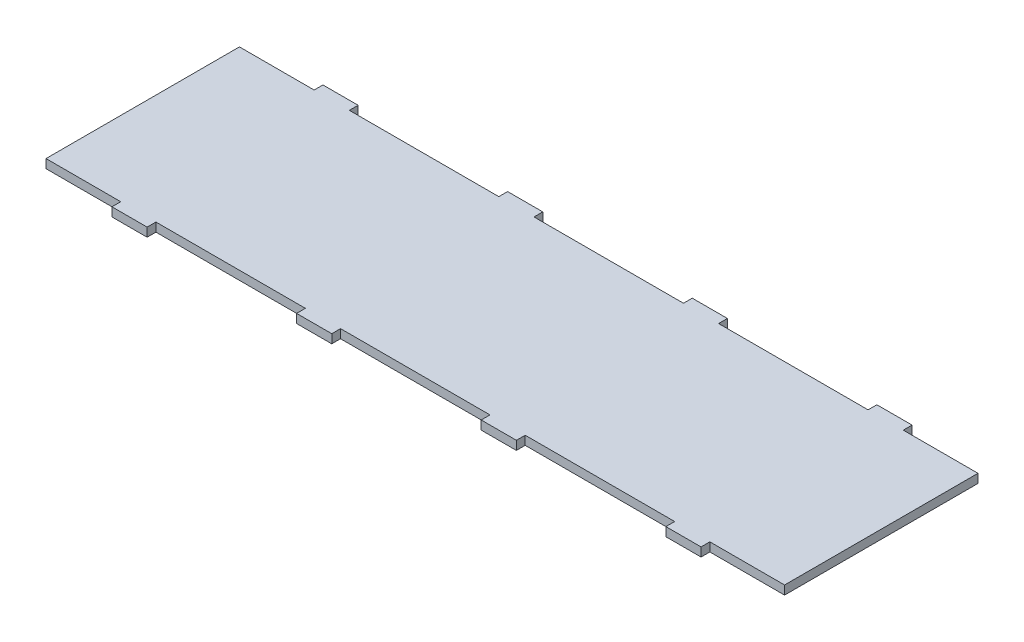
ISO-10303-21;
HEADER;
FILE_DESCRIPTION(('STEP AP214'),'2;1');
FILE_NAME('part.step','',(''),(''),'','','');
FILE_SCHEMA(('AUTOMOTIVE_DESIGN { 1 0 10303 214 1 1 1 1 }'));
ENDSEC;
DATA;
#1=APPLICATION_CONTEXT('core data for automotive mechanical design processes');
#2=APPLICATION_PROTOCOL_DEFINITION('international standard','automotive_design',2000,#1);
#3=PRODUCT_CONTEXT('',#1,'mechanical');
#4=PRODUCT('Part','Part','',(#3));
#5=PRODUCT_RELATED_PRODUCT_CATEGORY('part','',(#4));
#6=PRODUCT_DEFINITION_FORMATION('','',#4);
#7=PRODUCT_DEFINITION_CONTEXT('part definition',#1,'design');
#8=PRODUCT_DEFINITION('design','',#6,#7);
#9=PRODUCT_DEFINITION_SHAPE('','',#8);
#10=(LENGTH_UNIT() NAMED_UNIT(*) SI_UNIT(.MILLI.,.METRE.));
#11=(NAMED_UNIT(*) PLANE_ANGLE_UNIT() SI_UNIT($,.RADIAN.));
#12=(NAMED_UNIT(*) SI_UNIT($,.STERADIAN.) SOLID_ANGLE_UNIT());
#13=UNCERTAINTY_MEASURE_WITH_UNIT(LENGTH_MEASURE(1.E-05),#10,'distance_accuracy_value','');
#14=(GEOMETRIC_REPRESENTATION_CONTEXT(3) GLOBAL_UNCERTAINTY_ASSIGNED_CONTEXT((#13)) GLOBAL_UNIT_ASSIGNED_CONTEXT((#10,
#11,#12)) REPRESENTATION_CONTEXT('',''));
#15=CARTESIAN_POINT('',(0.,0.,0.));
#16=DIRECTION('',(0.,0.,1.));
#17=DIRECTION('',(1.,0.,0.));
#18=AXIS2_PLACEMENT_3D('',#15,#16,#17);
#19=CARTESIAN_POINT('',(266.7,6.35,-76.2));
#20=DIRECTION('',(-1.,0.,0.));
#21=DIRECTION('',(0.,0.,1.));
#22=AXIS2_PLACEMENT_3D('',#19,#20,#21);
#23=PLANE('',#22);
#24=DIRECTION('',(0.,-1.,0.));
#25=VECTOR('',#24,1.);
#26=CARTESIAN_POINT('',(266.7,6.35,-69.8500000000003));
#27=LINE('',#26,#25);
#28=CARTESIAN_POINT('',(266.7,6.35,-69.8500000000003));
#29=VERTEX_POINT('',#28);
#30=CARTESIAN_POINT('',(266.7,0.,-69.8500000000003));
#31=VERTEX_POINT('',#30);
#32=EDGE_CURVE('E447',#29,#31,#27,.T.);
#33=ORIENTED_EDGE('',*,*,#32,.F.);
#34=DIRECTION('',(0.,0.,-1.));
#35=VECTOR('',#34,1.);
#36=CARTESIAN_POINT('',(266.7,6.35,-76.2));
#37=LINE('',#36,#35);
#38=CARTESIAN_POINT('',(266.7,6.35,69.85));
#39=VERTEX_POINT('',#38);
#40=EDGE_CURVE('E331',#39,#29,#37,.T.);
#41=ORIENTED_EDGE('',*,*,#40,.F.);
#42=DIRECTION('',(0.,-1.,0.));
#43=VECTOR('',#42,1.);
#44=CARTESIAN_POINT('',(266.7,6.35,69.85));
#45=LINE('',#44,#43);
#46=CARTESIAN_POINT('',(266.7,0.,69.85));
#47=VERTEX_POINT('',#46);
#48=EDGE_CURVE('E362',#39,#47,#45,.T.);
#49=ORIENTED_EDGE('',*,*,#48,.T.);
#50=DIRECTION('',(0.,0.,-1.));
#51=VECTOR('',#50,1.);
#52=CARTESIAN_POINT('',(266.7,0.,-76.2));
#53=LINE('',#52,#51);
#54=EDGE_CURVE('E304',#47,#31,#53,.T.);
#55=ORIENTED_EDGE('',*,*,#54,.T.);
#56=EDGE_LOOP('',(#33,#41,#49,#55));
#57=FACE_BOUND('',#56,.T.);
#58=ADVANCED_FACE('F33',(#57),#23,.F.);
#59=CARTESIAN_POINT('',(-266.7,6.35,-76.2));
#60=DIRECTION('',(0.,0.,1.));
#61=DIRECTION('',(1.,0.,0.));
#62=AXIS2_PLACEMENT_3D('',#59,#60,#61);
#63=PLANE('',#62);
#64=DIRECTION('',(0.,1.,0.));
#65=VECTOR('',#64,1.);
#66=CARTESIAN_POINT('',(-212.725,0.,-76.1999999999998));
#67=LINE('',#66,#65);
#68=CARTESIAN_POINT('',(-212.725,0.,-76.1999999999998));
#69=VERTEX_POINT('',#68);
#70=CARTESIAN_POINT('',(-212.725,6.35,-76.1999999999998));
#71=VERTEX_POINT('',#70);
#72=EDGE_CURVE('E476',#69,#71,#67,.T.);
#73=ORIENTED_EDGE('',*,*,#72,.T.);
#74=DIRECTION('',(-1.,0.,0.));
#75=VECTOR('',#74,1.);
#76=CARTESIAN_POINT('',(-266.7,6.35,-76.2));
#77=LINE('',#76,#75);
#78=CARTESIAN_POINT('',(-187.325,6.35,-76.1999999999999));
#79=VERTEX_POINT('',#78);
#80=EDGE_CURVE('E327',#79,#71,#77,.T.);
#81=ORIENTED_EDGE('',*,*,#80,.F.);
#82=DIRECTION('',(0.,1.,0.));
#83=VECTOR('',#82,1.);
#84=CARTESIAN_POINT('',(-187.325,0.,-76.1999999999999));
#85=LINE('',#84,#83);
#86=CARTESIAN_POINT('',(-187.325,0.,-76.1999999999999));
#87=VERTEX_POINT('',#86);
#88=EDGE_CURVE('E493',#87,#79,#85,.T.);
#89=ORIENTED_EDGE('',*,*,#88,.F.);
#90=DIRECTION('',(-1.,0.,0.));
#91=VECTOR('',#90,1.);
#92=CARTESIAN_POINT('',(-266.7,0.,-76.2));
#93=LINE('',#92,#91);
#94=EDGE_CURVE('E297',#87,#69,#93,.T.);
#95=ORIENTED_EDGE('',*,*,#94,.T.);
#96=EDGE_LOOP('',(#73,#81,#89,#95));
#97=FACE_BOUND('',#96,.T.);
#98=ADVANCED_FACE('F571',(#97),#63,.F.);
#99=DIRECTION('',(0.,1.,0.));
#100=VECTOR('',#99,1.);
#101=CARTESIAN_POINT('',(-79.3749999999999,0.,-76.1999999999999));
#102=LINE('',#101,#100);
#103=CARTESIAN_POINT('',(-79.3749999999999,0.,-76.1999999999999));
#104=VERTEX_POINT('',#103);
#105=CARTESIAN_POINT('',(-79.3749999999999,6.35,-76.1999999999999));
#106=VERTEX_POINT('',#105);
#107=EDGE_CURVE('E490',#104,#106,#102,.T.);
#108=ORIENTED_EDGE('',*,*,#107,.T.);
#109=CARTESIAN_POINT('',(-53.9749999999999,6.35,-76.2));
#110=VERTEX_POINT('',#109);
#111=EDGE_CURVE('E330',#110,#106,#77,.T.);
#112=ORIENTED_EDGE('',*,*,#111,.F.);
#113=DIRECTION('',(0.,1.,0.));
#114=VECTOR('',#113,1.);
#115=CARTESIAN_POINT('',(-53.9749999999999,0.,-76.2));
#116=LINE('',#115,#114);
#117=CARTESIAN_POINT('',(-53.9749999999999,0.,-76.2));
#118=VERTEX_POINT('',#117);
#119=EDGE_CURVE('E453',#118,#110,#116,.T.);
#120=ORIENTED_EDGE('',*,*,#119,.F.);
#121=EDGE_CURVE('E301',#118,#104,#93,.T.);
#122=ORIENTED_EDGE('',*,*,#121,.T.);
#123=EDGE_LOOP('',(#108,#112,#120,#122));
#124=FACE_BOUND('',#123,.T.);
#125=ADVANCED_FACE('F560',(#124),#63,.F.);
#126=DIRECTION('',(0.,1.,0.));
#127=VECTOR('',#126,1.);
#128=CARTESIAN_POINT('',(212.725,0.,-76.2000000000003));
#129=LINE('',#128,#127);
#130=CARTESIAN_POINT('',(212.725,0.,-76.2000000000003));
#131=VERTEX_POINT('',#130);
#132=CARTESIAN_POINT('',(212.725,6.35,-76.2000000000003));
#133=VERTEX_POINT('',#132);
#134=EDGE_CURVE('E293',#131,#133,#129,.T.);
#135=ORIENTED_EDGE('',*,*,#134,.F.);
#136=CARTESIAN_POINT('',(187.325,0.,-76.2000000000001));
#137=VERTEX_POINT('',#136);
#138=EDGE_CURVE('E285',#131,#137,#93,.T.);
#139=ORIENTED_EDGE('',*,*,#138,.T.);
#140=DIRECTION('',(0.,1.,0.));
#141=VECTOR('',#140,1.);
#142=CARTESIAN_POINT('',(187.325,0.,-76.2000000000001));
#143=LINE('',#142,#141);
#144=CARTESIAN_POINT('',(187.325,6.35,-76.2000000000001));
#145=VERTEX_POINT('',#144);
#146=EDGE_CURVE('E264',#137,#145,#143,.T.);
#147=ORIENTED_EDGE('',*,*,#146,.T.);
#148=EDGE_CURVE('E326',#133,#145,#77,.T.);
#149=ORIENTED_EDGE('',*,*,#148,.F.);
#150=EDGE_LOOP('',(#135,#139,#147,#149));
#151=FACE_BOUND('',#150,.T.);
#152=ADVANCED_FACE('F292',(#151),#63,.F.);
#153=DIRECTION('',(0.,1.,0.));
#154=VECTOR('',#153,1.);
#155=CARTESIAN_POINT('',(79.3750000000001,0.,-76.2000000000001));
#156=LINE('',#155,#154);
#157=CARTESIAN_POINT('',(79.3750000000001,0.,-76.2000000000001));
#158=VERTEX_POINT('',#157);
#159=CARTESIAN_POINT('',(79.3750000000001,6.35,-76.2000000000001));
#160=VERTEX_POINT('',#159);
#161=EDGE_CURVE('E276',#158,#160,#156,.T.);
#162=ORIENTED_EDGE('',*,*,#161,.F.);
#163=CARTESIAN_POINT('',(53.9750000000001,0.,-76.2));
#164=VERTEX_POINT('',#163);
#165=EDGE_CURVE('E295',#158,#164,#93,.T.);
#166=ORIENTED_EDGE('',*,*,#165,.T.);
#167=DIRECTION('',(0.,1.,0.));
#168=VECTOR('',#167,1.);
#169=CARTESIAN_POINT('',(53.9750000000001,0.,-76.2));
#170=LINE('',#169,#168);
#171=CARTESIAN_POINT('',(53.9750000000001,6.35,-76.2));
#172=VERTEX_POINT('',#171);
#173=EDGE_CURVE('E450',#164,#172,#170,.T.);
#174=ORIENTED_EDGE('',*,*,#173,.T.);
#175=EDGE_CURVE('E544',#160,#172,#77,.T.);
#176=ORIENTED_EDGE('',*,*,#175,.F.);
#177=EDGE_LOOP('',(#162,#166,#174,#176));
#178=FACE_BOUND('',#177,.T.);
#179=ADVANCED_FACE('F542',(#178),#63,.F.);
#180=CARTESIAN_POINT('',(-266.7,6.35,-76.2));
#181=DIRECTION('',(1.,0.,0.));
#182=DIRECTION('',(0.,0.,-1.));
#183=AXIS2_PLACEMENT_3D('',#180,#181,#182);
#184=PLANE('',#183);
#185=DIRECTION('',(0.,1.,0.));
#186=VECTOR('',#185,1.);
#187=CARTESIAN_POINT('',(-266.7,6.35,-69.8499999999999));
#188=LINE('',#187,#186);
#189=CARTESIAN_POINT('',(-266.7,0.,-69.8499999999999));
#190=VERTEX_POINT('',#189);
#191=CARTESIAN_POINT('',(-266.7,6.35,-69.8499999999999));
#192=VERTEX_POINT('',#191);
#193=EDGE_CURVE('E404',#190,#192,#188,.T.);
#194=ORIENTED_EDGE('',*,*,#193,.F.);
#195=DIRECTION('',(0.,0.,1.));
#196=VECTOR('',#195,1.);
#197=CARTESIAN_POINT('',(-266.7,0.,-76.2));
#198=LINE('',#197,#196);
#199=CARTESIAN_POINT('',(-266.7,0.,69.8499999999999));
#200=VERTEX_POINT('',#199);
#201=EDGE_CURVE('E294',#190,#200,#198,.T.);
#202=ORIENTED_EDGE('',*,*,#201,.T.);
#203=DIRECTION('',(0.,1.,0.));
#204=VECTOR('',#203,1.);
#205=CARTESIAN_POINT('',(-266.7,6.35,69.85));
#206=LINE('',#205,#204);
#207=CARTESIAN_POINT('',(-266.7,6.35,69.85));
#208=VERTEX_POINT('',#207);
#209=EDGE_CURVE('E352',#200,#208,#206,.T.);
#210=ORIENTED_EDGE('',*,*,#209,.T.);
#211=DIRECTION('',(0.,0.,1.));
#212=VECTOR('',#211,1.);
#213=CARTESIAN_POINT('',(-266.7,6.35,-76.2));
#214=LINE('',#213,#212);
#215=EDGE_CURVE('E323',#192,#208,#214,.T.);
#216=ORIENTED_EDGE('',*,*,#215,.F.);
#217=EDGE_LOOP('',(#194,#202,#210,#216));
#218=FACE_BOUND('',#217,.T.);
#219=ADVANCED_FACE('F580',(#218),#184,.F.);
#220=CARTESIAN_POINT('',(0.,6.35,0.));
#221=DIRECTION('',(0.,1.,0.));
#222=DIRECTION('',(0.,0.,1.));
#223=AXIS2_PLACEMENT_3D('',#220,#221,#222);
#224=PLANE('',#223);
#225=ORIENTED_EDGE('',*,*,#80,.T.);
#226=DIRECTION('',(0.,0.,1.));
#227=VECTOR('',#226,1.);
#228=CARTESIAN_POINT('',(-212.725,6.35,-69.8499999999998));
#229=LINE('',#228,#227);
#230=CARTESIAN_POINT('',(-212.725,6.35,-69.8499999999998));
#231=VERTEX_POINT('',#230);
#232=EDGE_CURVE('E485',#71,#231,#229,.T.);
#233=ORIENTED_EDGE('',*,*,#232,.T.);
#234=DIRECTION('',(-1.,0.,0.));
#235=VECTOR('',#234,1.);
#236=CARTESIAN_POINT('',(-320.675,6.35,-69.8499999999999));
#237=LINE('',#236,#235);
#238=EDGE_CURVE('E481',#231,#192,#237,.T.);
#239=ORIENTED_EDGE('',*,*,#238,.T.);
#240=ORIENTED_EDGE('',*,*,#215,.T.);
#241=DIRECTION('',(-1.,0.,0.));
#242=VECTOR('',#241,1.);
#243=CARTESIAN_POINT('',(-320.675,6.35,69.85));
#244=LINE('',#243,#242);
#245=CARTESIAN_POINT('',(-212.725,6.35,69.85));
#246=VERTEX_POINT('',#245);
#247=EDGE_CURVE('E397',#246,#208,#244,.T.);
#248=ORIENTED_EDGE('',*,*,#247,.F.);
#249=DIRECTION('',(0.,0.,-1.));
#250=VECTOR('',#249,1.);
#251=CARTESIAN_POINT('',(-212.725,6.35,69.85));
#252=LINE('',#251,#250);
#253=CARTESIAN_POINT('',(-212.725,6.35,76.2));
#254=VERTEX_POINT('',#253);
#255=EDGE_CURVE('E401',#254,#246,#252,.T.);
#256=ORIENTED_EDGE('',*,*,#255,.F.);
#257=DIRECTION('',(1.,0.,0.));
#258=VECTOR('',#257,1.);
#259=CARTESIAN_POINT('',(-266.7,6.35,76.2));
#260=LINE('',#259,#258);
#261=CARTESIAN_POINT('',(-187.325,6.35,76.2));
#262=VERTEX_POINT('',#261);
#263=EDGE_CURVE('E321',#254,#262,#260,.T.);
#264=ORIENTED_EDGE('',*,*,#263,.T.);
#265=DIRECTION('',(0.,0.,1.));
#266=VECTOR('',#265,1.);
#267=CARTESIAN_POINT('',(-187.325,6.35,69.85));
#268=LINE('',#267,#266);
#269=CARTESIAN_POINT('',(-187.325,6.35,69.85));
#270=VERTEX_POINT('',#269);
#271=EDGE_CURVE('E420',#270,#262,#268,.T.);
#272=ORIENTED_EDGE('',*,*,#271,.F.);
#273=DIRECTION('',(-1.,0.,0.));
#274=VECTOR('',#273,1.);
#275=CARTESIAN_POINT('',(-187.325,6.35,69.85));
#276=LINE('',#275,#274);
#277=CARTESIAN_POINT('',(-79.3749999999999,6.35,69.85));
#278=VERTEX_POINT('',#277);
#279=EDGE_CURVE('E423',#278,#270,#276,.T.);
#280=ORIENTED_EDGE('',*,*,#279,.F.);
#281=DIRECTION('',(0.,0.,-1.));
#282=VECTOR('',#281,1.);
#283=CARTESIAN_POINT('',(-79.3749999999999,6.35,69.85));
#284=LINE('',#283,#282);
#285=CARTESIAN_POINT('',(-79.3749999999999,6.35,76.2));
#286=VERTEX_POINT('',#285);
#287=EDGE_CURVE('E396',#286,#278,#284,.T.);
#288=ORIENTED_EDGE('',*,*,#287,.F.);
#289=CARTESIAN_POINT('',(-53.9749999999999,6.35,76.2));
#290=VERTEX_POINT('',#289);
#291=EDGE_CURVE('E319',#286,#290,#260,.T.);
#292=ORIENTED_EDGE('',*,*,#291,.T.);
#293=DIRECTION('',(0.,0.,1.));
#294=VECTOR('',#293,1.);
#295=CARTESIAN_POINT('',(-53.9749999999999,6.35,69.85));
#296=LINE('',#295,#294);
#297=CARTESIAN_POINT('',(-53.9749999999999,6.35,69.85));
#298=VERTEX_POINT('',#297);
#299=EDGE_CURVE('E342',#298,#290,#296,.T.);
#300=ORIENTED_EDGE('',*,*,#299,.F.);
#301=DIRECTION('',(-1.,0.,0.));
#302=VECTOR('',#301,1.);
#303=CARTESIAN_POINT('',(-53.9749999999999,6.35,69.85));
#304=LINE('',#303,#302);
#305=CARTESIAN_POINT('',(53.9750000000001,6.35,69.85));
#306=VERTEX_POINT('',#305);
#307=EDGE_CURVE('E346',#306,#298,#304,.T.);
#308=ORIENTED_EDGE('',*,*,#307,.F.);
#309=DIRECTION('',(0.,0.,-1.));
#310=VECTOR('',#309,1.);
#311=CARTESIAN_POINT('',(53.9750000000001,6.35,69.85));
#312=LINE('',#311,#310);
#313=CARTESIAN_POINT('',(53.9750000000001,6.35,76.2));
#314=VERTEX_POINT('',#313);
#315=EDGE_CURVE('E349',#314,#306,#312,.T.);
#316=ORIENTED_EDGE('',*,*,#315,.F.);
#317=CARTESIAN_POINT('',(79.3750000000001,6.35,76.2));
#318=VERTEX_POINT('',#317);
#319=EDGE_CURVE('E322',#314,#318,#260,.T.);
#320=ORIENTED_EDGE('',*,*,#319,.T.);
#321=DIRECTION('',(0.,0.,1.));
#322=VECTOR('',#321,1.);
#323=CARTESIAN_POINT('',(79.3750000000001,6.35,69.85));
#324=LINE('',#323,#322);
#325=CARTESIAN_POINT('',(79.3750000000001,6.35,69.85));
#326=VERTEX_POINT('',#325);
#327=EDGE_CURVE('E374',#326,#318,#324,.T.);
#328=ORIENTED_EDGE('',*,*,#327,.F.);
#329=DIRECTION('',(-1.,0.,0.));
#330=VECTOR('',#329,1.);
#331=CARTESIAN_POINT('',(79.3750000000001,6.35,69.85));
#332=LINE('',#331,#330);
#333=CARTESIAN_POINT('',(187.325,6.35,69.85));
#334=VERTEX_POINT('',#333);
#335=EDGE_CURVE('E377',#334,#326,#332,.T.);
#336=ORIENTED_EDGE('',*,*,#335,.F.);
#337=DIRECTION('',(0.,0.,-1.));
#338=VECTOR('',#337,1.);
#339=CARTESIAN_POINT('',(187.325,6.35,69.85));
#340=LINE('',#339,#338);
#341=CARTESIAN_POINT('',(187.325,6.35,76.2));
#342=VERTEX_POINT('',#341);
#343=EDGE_CURVE('E380',#342,#334,#340,.T.);
#344=ORIENTED_EDGE('',*,*,#343,.F.);
#345=CARTESIAN_POINT('',(212.725,6.35,76.2));
#346=VERTEX_POINT('',#345);
#347=EDGE_CURVE('E325',#342,#346,#260,.T.);
#348=ORIENTED_EDGE('',*,*,#347,.T.);
#349=DIRECTION('',(0.,0.,1.));
#350=VECTOR('',#349,1.);
#351=CARTESIAN_POINT('',(212.725,6.35,69.85));
#352=LINE('',#351,#350);
#353=CARTESIAN_POINT('',(212.725,6.35,69.85));
#354=VERTEX_POINT('',#353);
#355=EDGE_CURVE('E441',#354,#346,#352,.T.);
#356=ORIENTED_EDGE('',*,*,#355,.F.);
#357=DIRECTION('',(-1.,0.,0.));
#358=VECTOR('',#357,1.);
#359=CARTESIAN_POINT('',(212.725,6.35,69.85));
#360=LINE('',#359,#358);
#361=EDGE_CURVE('E419',#39,#354,#360,.T.);
#362=ORIENTED_EDGE('',*,*,#361,.F.);
#363=ORIENTED_EDGE('',*,*,#40,.T.);
#364=DIRECTION('',(-1.,0.,0.));
#365=VECTOR('',#364,1.);
#366=CARTESIAN_POINT('',(212.725,6.35,-69.8500000000003));
#367=LINE('',#366,#365);
#368=CARTESIAN_POINT('',(212.725,6.35,-69.8500000000003));
#369=VERTEX_POINT('',#368);
#370=EDGE_CURVE('E518',#29,#369,#367,.T.);
#371=ORIENTED_EDGE('',*,*,#370,.T.);
#372=DIRECTION('',(0.,0.,-1.));
#373=VECTOR('',#372,1.);
#374=CARTESIAN_POINT('',(212.725,6.35,-69.8500000000003));
#375=LINE('',#374,#373);
#376=EDGE_CURVE('E500',#369,#133,#375,.T.);
#377=ORIENTED_EDGE('',*,*,#376,.T.);
#378=ORIENTED_EDGE('',*,*,#148,.T.);
#379=DIRECTION('',(0.,0.,1.));
#380=VECTOR('',#379,1.);
#381=CARTESIAN_POINT('',(187.325,6.35,-69.8500000000001));
#382=LINE('',#381,#380);
#383=CARTESIAN_POINT('',(187.325,6.35,-69.8500000000001));
#384=VERTEX_POINT('',#383);
#385=EDGE_CURVE('E271',#145,#384,#382,.T.);
#386=ORIENTED_EDGE('',*,*,#385,.T.);
#387=DIRECTION('',(-1.,0.,0.));
#388=VECTOR('',#387,1.);
#389=CARTESIAN_POINT('',(79.3750000000001,6.35,-69.8500000000001));
#390=LINE('',#389,#388);
#391=CARTESIAN_POINT('',(79.3750000000001,6.35,-69.8500000000001));
#392=VERTEX_POINT('',#391);
#393=EDGE_CURVE('E289',#384,#392,#390,.T.);
#394=ORIENTED_EDGE('',*,*,#393,.T.);
#395=DIRECTION('',(0.,0.,-1.));
#396=VECTOR('',#395,1.);
#397=CARTESIAN_POINT('',(79.3750000000001,6.35,-69.8500000000001));
#398=LINE('',#397,#396);
#399=EDGE_CURVE('E530',#392,#160,#398,.T.);
#400=ORIENTED_EDGE('',*,*,#399,.T.);
#401=ORIENTED_EDGE('',*,*,#175,.T.);
#402=DIRECTION('',(0.,0.,1.));
#403=VECTOR('',#402,1.);
#404=CARTESIAN_POINT('',(53.9750000000001,6.35,-69.85));
#405=LINE('',#404,#403);
#406=CARTESIAN_POINT('',(53.9750000000001,6.35,-69.85));
#407=VERTEX_POINT('',#406);
#408=EDGE_CURVE('E467',#172,#407,#405,.T.);
#409=ORIENTED_EDGE('',*,*,#408,.T.);
#410=DIRECTION('',(-1.,0.,0.));
#411=VECTOR('',#410,1.);
#412=CARTESIAN_POINT('',(-53.9749999999999,6.35,-69.85));
#413=LINE('',#412,#411);
#414=CARTESIAN_POINT('',(-53.9749999999999,6.35,-69.85));
#415=VERTEX_POINT('',#414);
#416=EDGE_CURVE('E460',#407,#415,#413,.T.);
#417=ORIENTED_EDGE('',*,*,#416,.T.);
#418=DIRECTION('',(0.,0.,-1.));
#419=VECTOR('',#418,1.);
#420=CARTESIAN_POINT('',(-53.9749999999999,6.35,-69.85));
#421=LINE('',#420,#419);
#422=EDGE_CURVE('E464',#415,#110,#421,.T.);
#423=ORIENTED_EDGE('',*,*,#422,.T.);
#424=ORIENTED_EDGE('',*,*,#111,.T.);
#425=DIRECTION('',(0.,0.,1.));
#426=VECTOR('',#425,1.);
#427=CARTESIAN_POINT('',(-79.3749999999999,6.35,-69.8499999999999));
#428=LINE('',#427,#426);
#429=CARTESIAN_POINT('',(-79.3749999999999,6.35,-69.8499999999999));
#430=VERTEX_POINT('',#429);
#431=EDGE_CURVE('E480',#106,#430,#428,.T.);
#432=ORIENTED_EDGE('',*,*,#431,.T.);
#433=DIRECTION('',(-1.,0.,0.));
#434=VECTOR('',#433,1.);
#435=CARTESIAN_POINT('',(-187.325,6.35,-69.8499999999999));
#436=LINE('',#435,#434);
#437=CARTESIAN_POINT('',(-187.325,6.35,-69.8499999999999));
#438=VERTEX_POINT('',#437);
#439=EDGE_CURVE('E501',#430,#438,#436,.T.);
#440=ORIENTED_EDGE('',*,*,#439,.T.);
#441=DIRECTION('',(0.,0.,-1.));
#442=VECTOR('',#441,1.);
#443=CARTESIAN_POINT('',(-187.325,6.35,-69.8499999999999));
#444=LINE('',#443,#442);
#445=EDGE_CURVE('E505',#438,#79,#444,.T.);
#446=ORIENTED_EDGE('',*,*,#445,.T.);
#447=EDGE_LOOP('',(#225,#233,#239,#240,#248,#256,#264,#272,#280,#288,#292,#300,#308,#316,#320,
#328,#336,#344,#348,#356,#362,#363,#371,#377,#378,#386,#394,#400,#401,#409,#417,#423,#424,#432,
#440,#446));
#448=FACE_BOUND('',#447,.T.);
#449=ADVANCED_FACE('F555',(#448),#224,.T.);
#450=CARTESIAN_POINT('',(0.,0.,0.));
#451=DIRECTION('',(0.,1.,0.));
#452=DIRECTION('',(0.,0.,1.));
#453=AXIS2_PLACEMENT_3D('',#450,#451,#452);
#454=PLANE('',#453);
#455=DIRECTION('',(0.,0.,1.));
#456=VECTOR('',#455,1.);
#457=CARTESIAN_POINT('',(-212.725,0.,-69.8499999999998));
#458=LINE('',#457,#456);
#459=CARTESIAN_POINT('',(-212.725,0.,-69.8499999999998));
#460=VERTEX_POINT('',#459);
#461=EDGE_CURVE('E484',#69,#460,#458,.T.);
#462=ORIENTED_EDGE('',*,*,#461,.F.);
#463=ORIENTED_EDGE('',*,*,#94,.F.);
#464=DIRECTION('',(0.,0.,-1.));
#465=VECTOR('',#464,1.);
#466=CARTESIAN_POINT('',(-187.325,0.,-69.8499999999999));
#467=LINE('',#466,#465);
#468=CARTESIAN_POINT('',(-187.325,0.,-69.8499999999999));
#469=VERTEX_POINT('',#468);
#470=EDGE_CURVE('E511',#469,#87,#467,.T.);
#471=ORIENTED_EDGE('',*,*,#470,.F.);
#472=DIRECTION('',(-1.,0.,0.));
#473=VECTOR('',#472,1.);
#474=CARTESIAN_POINT('',(-187.325,0.,-69.8499999999999));
#475=LINE('',#474,#473);
#476=CARTESIAN_POINT('',(-79.3749999999999,0.,-69.8499999999999));
#477=VERTEX_POINT('',#476);
#478=EDGE_CURVE('E494',#477,#469,#475,.T.);
#479=ORIENTED_EDGE('',*,*,#478,.F.);
#480=DIRECTION('',(0.,0.,1.));
#481=VECTOR('',#480,1.);
#482=CARTESIAN_POINT('',(-79.3749999999999,0.,-69.8499999999999));
#483=LINE('',#482,#481);
#484=EDGE_CURVE('E504',#104,#477,#483,.T.);
#485=ORIENTED_EDGE('',*,*,#484,.F.);
#486=ORIENTED_EDGE('',*,*,#121,.F.);
#487=DIRECTION('',(0.,0.,-1.));
#488=VECTOR('',#487,1.);
#489=CARTESIAN_POINT('',(-53.9749999999999,0.,-69.85));
#490=LINE('',#489,#488);
#491=CARTESIAN_POINT('',(-53.9749999999999,0.,-69.85));
#492=VERTEX_POINT('',#491);
#493=EDGE_CURVE('E473',#492,#118,#490,.T.);
#494=ORIENTED_EDGE('',*,*,#493,.F.);
#495=DIRECTION('',(-1.,0.,0.));
#496=VECTOR('',#495,1.);
#497=CARTESIAN_POINT('',(-53.9749999999999,0.,-69.85));
#498=LINE('',#497,#496);
#499=CARTESIAN_POINT('',(53.9750000000001,0.,-69.85));
#500=VERTEX_POINT('',#499);
#501=EDGE_CURVE('E454',#500,#492,#498,.T.);
#502=ORIENTED_EDGE('',*,*,#501,.F.);
#503=DIRECTION('',(0.,0.,1.));
#504=VECTOR('',#503,1.);
#505=CARTESIAN_POINT('',(53.9750000000001,0.,-69.85));
#506=LINE('',#505,#504);
#507=EDGE_CURVE('E463',#164,#500,#506,.T.);
#508=ORIENTED_EDGE('',*,*,#507,.F.);
#509=ORIENTED_EDGE('',*,*,#165,.F.);
#510=DIRECTION('',(0.,0.,-1.));
#511=VECTOR('',#510,1.);
#512=CARTESIAN_POINT('',(79.3750000000001,0.,-69.8500000000001));
#513=LINE('',#512,#511);
#514=CARTESIAN_POINT('',(79.3750000000001,0.,-69.8500000000001));
#515=VERTEX_POINT('',#514);
#516=EDGE_CURVE('E288',#515,#158,#513,.T.);
#517=ORIENTED_EDGE('',*,*,#516,.F.);
#518=DIRECTION('',(-1.,0.,0.));
#519=VECTOR('',#518,1.);
#520=CARTESIAN_POINT('',(79.3750000000001,0.,-69.8500000000001));
#521=LINE('',#520,#519);
#522=CARTESIAN_POINT('',(187.325,0.,-69.8500000000001));
#523=VERTEX_POINT('',#522);
#524=EDGE_CURVE('E277',#523,#515,#521,.T.);
#525=ORIENTED_EDGE('',*,*,#524,.F.);
#526=DIRECTION('',(0.,0.,1.));
#527=VECTOR('',#526,1.);
#528=CARTESIAN_POINT('',(187.325,0.,-69.8500000000001));
#529=LINE('',#528,#527);
#530=EDGE_CURVE('E268',#137,#523,#529,.T.);
#531=ORIENTED_EDGE('',*,*,#530,.F.);
#532=ORIENTED_EDGE('',*,*,#138,.F.);
#533=DIRECTION('',(0.,0.,-1.));
#534=VECTOR('',#533,1.);
#535=CARTESIAN_POINT('',(212.725,0.,-69.8500000000003));
#536=LINE('',#535,#534);
#537=CARTESIAN_POINT('',(212.725,0.,-69.8500000000003));
#538=VERTEX_POINT('',#537);
#539=EDGE_CURVE('E516',#538,#131,#536,.T.);
#540=ORIENTED_EDGE('',*,*,#539,.F.);
#541=DIRECTION('',(-1.,0.,0.));
#542=VECTOR('',#541,1.);
#543=CARTESIAN_POINT('',(0.,0.,-69.8500000000003));
#544=LINE('',#543,#542);
#545=EDGE_CURVE('E11',#31,#538,#544,.T.);
#546=ORIENTED_EDGE('',*,*,#545,.F.);
#547=ORIENTED_EDGE('',*,*,#54,.F.);
#548=DIRECTION('',(-1.,0.,0.));
#549=VECTOR('',#548,1.);
#550=CARTESIAN_POINT('',(0.,0.,69.85));
#551=LINE('',#550,#549);
#552=CARTESIAN_POINT('',(212.725,0.,69.85));
#553=VERTEX_POINT('',#552);
#554=EDGE_CURVE('E40',#47,#553,#551,.T.);
#555=ORIENTED_EDGE('',*,*,#554,.T.);
#556=DIRECTION('',(0.,0.,1.));
#557=VECTOR('',#556,1.);
#558=CARTESIAN_POINT('',(212.725,0.,69.85));
#559=LINE('',#558,#557);
#560=CARTESIAN_POINT('',(212.725,0.,76.2));
#561=VERTEX_POINT('',#560);
#562=EDGE_CURVE('E438',#553,#561,#559,.T.);
#563=ORIENTED_EDGE('',*,*,#562,.T.);
#564=DIRECTION('',(1.,0.,0.));
#565=VECTOR('',#564,1.);
#566=CARTESIAN_POINT('',(-266.7,0.,76.2));
#567=LINE('',#566,#565);
#568=CARTESIAN_POINT('',(187.325,0.,76.2));
#569=VERTEX_POINT('',#568);
#570=EDGE_CURVE('E298',#569,#561,#567,.T.);
#571=ORIENTED_EDGE('',*,*,#570,.F.);
#572=DIRECTION('',(0.,0.,-1.));
#573=VECTOR('',#572,1.);
#574=CARTESIAN_POINT('',(187.325,0.,69.85));
#575=LINE('',#574,#573);
#576=CARTESIAN_POINT('',(187.325,0.,69.85));
#577=VERTEX_POINT('',#576);
#578=EDGE_CURVE('E376',#569,#577,#575,.T.);
#579=ORIENTED_EDGE('',*,*,#578,.T.);
#580=DIRECTION('',(-1.,0.,0.));
#581=VECTOR('',#580,1.);
#582=CARTESIAN_POINT('',(79.3750000000001,0.,69.85));
#583=LINE('',#582,#581);
#584=CARTESIAN_POINT('',(79.3750000000001,0.,69.85));
#585=VERTEX_POINT('',#584);
#586=EDGE_CURVE('E386',#577,#585,#583,.T.);
#587=ORIENTED_EDGE('',*,*,#586,.T.);
#588=DIRECTION('',(0.,0.,1.));
#589=VECTOR('',#588,1.);
#590=CARTESIAN_POINT('',(79.3750000000001,0.,69.85));
#591=LINE('',#590,#589);
#592=CARTESIAN_POINT('',(79.3750000000001,0.,76.2));
#593=VERTEX_POINT('',#592);
#594=EDGE_CURVE('E368',#585,#593,#591,.T.);
#595=ORIENTED_EDGE('',*,*,#594,.T.);
#596=CARTESIAN_POINT('',(53.9750000000001,0.,76.2));
#597=VERTEX_POINT('',#596);
#598=EDGE_CURVE('E613',#597,#593,#567,.T.);
#599=ORIENTED_EDGE('',*,*,#598,.F.);
#600=DIRECTION('',(0.,0.,-1.));
#601=VECTOR('',#600,1.);
#602=CARTESIAN_POINT('',(53.9750000000001,0.,69.85));
#603=LINE('',#602,#601);
#604=CARTESIAN_POINT('',(53.9750000000001,0.,69.85));
#605=VERTEX_POINT('',#604);
#606=EDGE_CURVE('E345',#597,#605,#603,.T.);
#607=ORIENTED_EDGE('',*,*,#606,.T.);
#608=DIRECTION('',(-1.,0.,0.));
#609=VECTOR('',#608,1.);
#610=CARTESIAN_POINT('',(-53.9749999999999,0.,69.85));
#611=LINE('',#610,#609);
#612=CARTESIAN_POINT('',(-53.9749999999999,0.,69.85));
#613=VERTEX_POINT('',#612);
#614=EDGE_CURVE('E355',#605,#613,#611,.T.);
#615=ORIENTED_EDGE('',*,*,#614,.T.);
#616=DIRECTION('',(0.,0.,1.));
#617=VECTOR('',#616,1.);
#618=CARTESIAN_POINT('',(-53.9749999999999,0.,69.85));
#619=LINE('',#618,#617);
#620=CARTESIAN_POINT('',(-53.9749999999999,0.,76.2));
#621=VERTEX_POINT('',#620);
#622=EDGE_CURVE('E338',#613,#621,#619,.T.);
#623=ORIENTED_EDGE('',*,*,#622,.T.);
#624=CARTESIAN_POINT('',(-79.3749999999999,0.,76.2));
#625=VERTEX_POINT('',#624);
#626=EDGE_CURVE('E959',#625,#621,#567,.T.);
#627=ORIENTED_EDGE('',*,*,#626,.F.);
#628=DIRECTION('',(0.,0.,-1.));
#629=VECTOR('',#628,1.);
#630=CARTESIAN_POINT('',(-79.3749999999999,0.,69.85));
#631=LINE('',#630,#629);
#632=CARTESIAN_POINT('',(-79.3749999999999,0.,69.85));
#633=VERTEX_POINT('',#632);
#634=EDGE_CURVE('E422',#625,#633,#631,.T.);
#635=ORIENTED_EDGE('',*,*,#634,.T.);
#636=DIRECTION('',(-1.,0.,0.));
#637=VECTOR('',#636,1.);
#638=CARTESIAN_POINT('',(-187.325,0.,69.85));
#639=LINE('',#638,#637);
#640=CARTESIAN_POINT('',(-187.325,0.,69.85));
#641=VERTEX_POINT('',#640);
#642=EDGE_CURVE('E430',#633,#641,#639,.T.);
#643=ORIENTED_EDGE('',*,*,#642,.T.);
#644=DIRECTION('',(0.,0.,1.));
#645=VECTOR('',#644,1.);
#646=CARTESIAN_POINT('',(-187.325,0.,69.85));
#647=LINE('',#646,#645);
#648=CARTESIAN_POINT('',(-187.325,0.,76.2));
#649=VERTEX_POINT('',#648);
#650=EDGE_CURVE('E412',#641,#649,#647,.T.);
#651=ORIENTED_EDGE('',*,*,#650,.T.);
#652=CARTESIAN_POINT('',(-212.725,0.,76.2));
#653=VERTEX_POINT('',#652);
#654=EDGE_CURVE('E334',#653,#649,#567,.T.);
#655=ORIENTED_EDGE('',*,*,#654,.F.);
#656=DIRECTION('',(0.,0.,-1.));
#657=VECTOR('',#656,1.);
#658=CARTESIAN_POINT('',(-212.725,0.,69.85));
#659=LINE('',#658,#657);
#660=CARTESIAN_POINT('',(-212.725,0.,69.85));
#661=VERTEX_POINT('',#660);
#662=EDGE_CURVE('E400',#653,#661,#659,.T.);
#663=ORIENTED_EDGE('',*,*,#662,.T.);
#664=DIRECTION('',(-1.,0.,0.));
#665=VECTOR('',#664,1.);
#666=CARTESIAN_POINT('',(-320.675,0.,69.85));
#667=LINE('',#666,#665);
#668=EDGE_CURVE('E394',#661,#200,#667,.T.);
#669=ORIENTED_EDGE('',*,*,#668,.T.);
#670=ORIENTED_EDGE('',*,*,#201,.F.);
#671=DIRECTION('',(-1.,0.,0.));
#672=VECTOR('',#671,1.);
#673=CARTESIAN_POINT('',(-320.675,0.,-69.8499999999999));
#674=LINE('',#673,#672);
#675=EDGE_CURVE('E478',#460,#190,#674,.T.);
#676=ORIENTED_EDGE('',*,*,#675,.F.);
#677=EDGE_LOOP('',(#462,#463,#471,#479,#485,#486,#494,#502,#508,#509,#517,#525,#531,#532,#540,
#546,#547,#555,#563,#571,#579,#587,#595,#599,#607,#615,#623,#627,#635,#643,#651,#655,#663,#669,
#670,#676));
#678=FACE_BOUND('',#677,.T.);
#679=ADVANCED_FACE('F283',(#678),#454,.F.);
#680=CARTESIAN_POINT('',(-266.7,6.35,76.2));
#681=DIRECTION('',(0.,0.,-1.));
#682=DIRECTION('',(-1.,0.,0.));
#683=AXIS2_PLACEMENT_3D('',#680,#681,#682);
#684=PLANE('',#683);
#685=ORIENTED_EDGE('',*,*,#570,.T.);
#686=DIRECTION('',(0.,1.,0.));
#687=VECTOR('',#686,1.);
#688=CARTESIAN_POINT('',(212.725,0.,76.2));
#689=LINE('',#688,#687);
#690=EDGE_CURVE('E383',#561,#346,#689,.T.);
#691=ORIENTED_EDGE('',*,*,#690,.T.);
#692=ORIENTED_EDGE('',*,*,#347,.F.);
#693=DIRECTION('',(0.,1.,0.));
#694=VECTOR('',#693,1.);
#695=CARTESIAN_POINT('',(187.325,0.,76.2));
#696=LINE('',#695,#694);
#697=EDGE_CURVE('E364',#569,#342,#696,.T.);
#698=ORIENTED_EDGE('',*,*,#697,.F.);
#699=EDGE_LOOP('',(#685,#691,#692,#698));
#700=FACE_BOUND('',#699,.T.);
#701=ADVANCED_FACE('F625',(#700),#684,.F.);
#702=ORIENTED_EDGE('',*,*,#291,.F.);
#703=DIRECTION('',(0.,1.,0.));
#704=VECTOR('',#703,1.);
#705=CARTESIAN_POINT('',(-79.3749999999999,0.,76.2));
#706=LINE('',#705,#704);
#707=EDGE_CURVE('E417',#625,#286,#706,.T.);
#708=ORIENTED_EDGE('',*,*,#707,.F.);
#709=ORIENTED_EDGE('',*,*,#626,.T.);
#710=DIRECTION('',(0.,1.,0.));
#711=VECTOR('',#710,1.);
#712=CARTESIAN_POINT('',(-53.9749999999999,0.,76.2));
#713=LINE('',#712,#711);
#714=EDGE_CURVE('E316',#621,#290,#713,.T.);
#715=ORIENTED_EDGE('',*,*,#714,.T.);
#716=EDGE_LOOP('',(#702,#708,#709,#715));
#717=FACE_BOUND('',#716,.T.);
#718=ADVANCED_FACE('F787',(#717),#684,.F.);
#719=ORIENTED_EDGE('',*,*,#598,.T.);
#720=DIRECTION('',(0.,1.,0.));
#721=VECTOR('',#720,1.);
#722=CARTESIAN_POINT('',(79.3750000000001,0.,76.2));
#723=LINE('',#722,#721);
#724=EDGE_CURVE('E370',#593,#318,#723,.T.);
#725=ORIENTED_EDGE('',*,*,#724,.T.);
#726=ORIENTED_EDGE('',*,*,#319,.F.);
#727=DIRECTION('',(0.,1.,0.));
#728=VECTOR('',#727,1.);
#729=CARTESIAN_POINT('',(53.9750000000001,0.,76.2));
#730=LINE('',#729,#728);
#731=EDGE_CURVE('E311',#597,#314,#730,.T.);
#732=ORIENTED_EDGE('',*,*,#731,.F.);
#733=EDGE_LOOP('',(#719,#725,#726,#732));
#734=FACE_BOUND('',#733,.T.);
#735=ADVANCED_FACE('F611',(#734),#684,.F.);
#736=ORIENTED_EDGE('',*,*,#263,.F.);
#737=DIRECTION('',(0.,1.,0.));
#738=VECTOR('',#737,1.);
#739=CARTESIAN_POINT('',(-212.725,0.,76.2));
#740=LINE('',#739,#738);
#741=EDGE_CURVE('E393',#653,#254,#740,.T.);
#742=ORIENTED_EDGE('',*,*,#741,.F.);
#743=ORIENTED_EDGE('',*,*,#654,.T.);
#744=DIRECTION('',(0.,1.,0.));
#745=VECTOR('',#744,1.);
#746=CARTESIAN_POINT('',(-187.325,0.,76.2));
#747=LINE('',#746,#745);
#748=EDGE_CURVE('E414',#649,#262,#747,.T.);
#749=ORIENTED_EDGE('',*,*,#748,.T.);
#750=EDGE_LOOP('',(#736,#742,#743,#749));
#751=FACE_BOUND('',#750,.T.);
#752=ADVANCED_FACE('F594',(#751),#684,.F.);
#753=CARTESIAN_POINT('',(53.9750000000001,0.,69.85));
#754=DIRECTION('',(1.,0.,0.));
#755=DIRECTION('',(0.,0.,-1.));
#756=AXIS2_PLACEMENT_3D('',#753,#754,#755);
#757=PLANE('',#756);
#758=ORIENTED_EDGE('',*,*,#315,.T.);
#759=DIRECTION('',(0.,1.,0.));
#760=VECTOR('',#759,1.);
#761=CARTESIAN_POINT('',(53.9750000000001,0.,69.85));
#762=LINE('',#761,#760);
#763=EDGE_CURVE('E335',#605,#306,#762,.T.);
#764=ORIENTED_EDGE('',*,*,#763,.F.);
#765=ORIENTED_EDGE('',*,*,#606,.F.);
#766=ORIENTED_EDGE('',*,*,#731,.T.);
#767=EDGE_LOOP('',(#758,#764,#765,#766));
#768=FACE_BOUND('',#767,.T.);
#769=ADVANCED_FACE('F777',(#768),#757,.F.);
#770=CARTESIAN_POINT('',(-53.9749999999999,0.,69.85));
#771=DIRECTION('',(-1.,0.,0.));
#772=DIRECTION('',(0.,0.,1.));
#773=AXIS2_PLACEMENT_3D('',#770,#771,#772);
#774=PLANE('',#773);
#775=ORIENTED_EDGE('',*,*,#299,.T.);
#776=ORIENTED_EDGE('',*,*,#714,.F.);
#777=ORIENTED_EDGE('',*,*,#622,.F.);
#778=DIRECTION('',(0.,1.,0.));
#779=VECTOR('',#778,1.);
#780=CARTESIAN_POINT('',(-53.9749999999999,0.,69.85));
#781=LINE('',#780,#779);
#782=EDGE_CURVE('E337',#613,#298,#781,.T.);
#783=ORIENTED_EDGE('',*,*,#782,.T.);
#784=EDGE_LOOP('',(#775,#776,#777,#783));
#785=FACE_BOUND('',#784,.T.);
#786=ADVANCED_FACE('F810',(#785),#774,.F.);
#787=CARTESIAN_POINT('',(-53.9749999999999,0.,69.85));
#788=DIRECTION('',(0.,0.,-1.));
#789=DIRECTION('',(-1.,0.,0.));
#790=AXIS2_PLACEMENT_3D('',#787,#788,#789);
#791=PLANE('',#790);
#792=ORIENTED_EDGE('',*,*,#307,.T.);
#793=ORIENTED_EDGE('',*,*,#782,.F.);
#794=ORIENTED_EDGE('',*,*,#614,.F.);
#795=ORIENTED_EDGE('',*,*,#763,.T.);
#796=EDGE_LOOP('',(#792,#793,#794,#795));
#797=FACE_BOUND('',#796,.T.);
#798=ADVANCED_FACE('F766',(#797),#791,.F.);
#799=CARTESIAN_POINT('',(187.325,0.,69.85));
#800=DIRECTION('',(1.,0.,0.));
#801=DIRECTION('',(0.,0.,-1.));
#802=AXIS2_PLACEMENT_3D('',#799,#800,#801);
#803=PLANE('',#802);
#804=ORIENTED_EDGE('',*,*,#343,.T.);
#805=DIRECTION('',(0.,1.,0.));
#806=VECTOR('',#805,1.);
#807=CARTESIAN_POINT('',(187.325,0.,69.85));
#808=LINE('',#807,#806);
#809=EDGE_CURVE('E365',#577,#334,#808,.T.);
#810=ORIENTED_EDGE('',*,*,#809,.F.);
#811=ORIENTED_EDGE('',*,*,#578,.F.);
#812=ORIENTED_EDGE('',*,*,#697,.T.);
#813=EDGE_LOOP('',(#804,#810,#811,#812));
#814=FACE_BOUND('',#813,.T.);
#815=ADVANCED_FACE('F757',(#814),#803,.F.);
#816=CARTESIAN_POINT('',(79.3750000000001,0.,69.85));
#817=DIRECTION('',(-1.,0.,0.));
#818=DIRECTION('',(0.,0.,1.));
#819=AXIS2_PLACEMENT_3D('',#816,#817,#818);
#820=PLANE('',#819);
#821=ORIENTED_EDGE('',*,*,#327,.T.);
#822=ORIENTED_EDGE('',*,*,#724,.F.);
#823=ORIENTED_EDGE('',*,*,#594,.F.);
#824=DIRECTION('',(0.,1.,0.));
#825=VECTOR('',#824,1.);
#826=CARTESIAN_POINT('',(79.3750000000001,0.,69.85));
#827=LINE('',#826,#825);
#828=EDGE_CURVE('E367',#585,#326,#827,.T.);
#829=ORIENTED_EDGE('',*,*,#828,.T.);
#830=EDGE_LOOP('',(#821,#822,#823,#829));
#831=FACE_BOUND('',#830,.T.);
#832=ADVANCED_FACE('F615',(#831),#820,.F.);
#833=CARTESIAN_POINT('',(79.3750000000001,0.,69.85));
#834=DIRECTION('',(0.,0.,-1.));
#835=DIRECTION('',(-1.,0.,0.));
#836=AXIS2_PLACEMENT_3D('',#833,#834,#835);
#837=PLANE('',#836);
#838=ORIENTED_EDGE('',*,*,#335,.T.);
#839=ORIENTED_EDGE('',*,*,#828,.F.);
#840=ORIENTED_EDGE('',*,*,#586,.F.);
#841=ORIENTED_EDGE('',*,*,#809,.T.);
#842=EDGE_LOOP('',(#838,#839,#840,#841));
#843=FACE_BOUND('',#842,.T.);
#844=ADVANCED_FACE('F620',(#843),#837,.F.);
#845=CARTESIAN_POINT('',(212.725,0.,69.85));
#846=DIRECTION('',(0.,0.,-1.));
#847=DIRECTION('',(-1.,0.,0.));
#848=AXIS2_PLACEMENT_3D('',#845,#846,#847);
#849=PLANE('',#848);
#850=ORIENTED_EDGE('',*,*,#361,.T.);
#851=DIRECTION('',(0.,1.,0.));
#852=VECTOR('',#851,1.);
#853=CARTESIAN_POINT('',(212.725,0.,69.85));
#854=LINE('',#853,#852);
#855=EDGE_CURVE('E435',#553,#354,#854,.T.);
#856=ORIENTED_EDGE('',*,*,#855,.F.);
#857=ORIENTED_EDGE('',*,*,#554,.F.);
#858=ORIENTED_EDGE('',*,*,#48,.F.);
#859=EDGE_LOOP('',(#850,#856,#857,#858));
#860=FACE_BOUND('',#859,.T.);
#861=ADVANCED_FACE('F631',(#860),#849,.F.);
#862=CARTESIAN_POINT('',(212.725,0.,69.85));
#863=DIRECTION('',(-1.,0.,0.));
#864=DIRECTION('',(0.,0.,1.));
#865=AXIS2_PLACEMENT_3D('',#862,#863,#864);
#866=PLANE('',#865);
#867=ORIENTED_EDGE('',*,*,#355,.T.);
#868=ORIENTED_EDGE('',*,*,#690,.F.);
#869=ORIENTED_EDGE('',*,*,#562,.F.);
#870=ORIENTED_EDGE('',*,*,#855,.T.);
#871=EDGE_LOOP('',(#867,#868,#869,#870));
#872=FACE_BOUND('',#871,.T.);
#873=ADVANCED_FACE('F627',(#872),#866,.F.);
#874=CARTESIAN_POINT('',(-79.3749999999999,0.,69.85));
#875=DIRECTION('',(1.,0.,0.));
#876=DIRECTION('',(0.,0.,-1.));
#877=AXIS2_PLACEMENT_3D('',#874,#875,#876);
#878=PLANE('',#877);
#879=ORIENTED_EDGE('',*,*,#287,.T.);
#880=DIRECTION('',(0.,1.,0.));
#881=VECTOR('',#880,1.);
#882=CARTESIAN_POINT('',(-79.3749999999999,0.,69.85));
#883=LINE('',#882,#881);
#884=EDGE_CURVE('E409',#633,#278,#883,.T.);
#885=ORIENTED_EDGE('',*,*,#884,.F.);
#886=ORIENTED_EDGE('',*,*,#634,.F.);
#887=ORIENTED_EDGE('',*,*,#707,.T.);
#888=EDGE_LOOP('',(#879,#885,#886,#887));
#889=FACE_BOUND('',#888,.T.);
#890=ADVANCED_FACE('F714',(#889),#878,.F.);
#891=CARTESIAN_POINT('',(-187.325,0.,69.85));
#892=DIRECTION('',(-1.,0.,0.));
#893=DIRECTION('',(0.,0.,1.));
#894=AXIS2_PLACEMENT_3D('',#891,#892,#893);
#895=PLANE('',#894);
#896=ORIENTED_EDGE('',*,*,#271,.T.);
#897=ORIENTED_EDGE('',*,*,#748,.F.);
#898=ORIENTED_EDGE('',*,*,#650,.F.);
#899=DIRECTION('',(0.,1.,0.));
#900=VECTOR('',#899,1.);
#901=CARTESIAN_POINT('',(-187.325,0.,69.85));
#902=LINE('',#901,#900);
#903=EDGE_CURVE('E411',#641,#270,#902,.T.);
#904=ORIENTED_EDGE('',*,*,#903,.T.);
#905=EDGE_LOOP('',(#896,#897,#898,#904));
#906=FACE_BOUND('',#905,.T.);
#907=ADVANCED_FACE('F704',(#906),#895,.F.);
#908=CARTESIAN_POINT('',(-187.325,0.,69.85));
#909=DIRECTION('',(0.,0.,-1.));
#910=DIRECTION('',(-1.,0.,0.));
#911=AXIS2_PLACEMENT_3D('',#908,#909,#910);
#912=PLANE('',#911);
#913=ORIENTED_EDGE('',*,*,#279,.T.);
#914=ORIENTED_EDGE('',*,*,#903,.F.);
#915=ORIENTED_EDGE('',*,*,#642,.F.);
#916=ORIENTED_EDGE('',*,*,#884,.T.);
#917=EDGE_LOOP('',(#913,#914,#915,#916));
#918=FACE_BOUND('',#917,.T.);
#919=ADVANCED_FACE('F695',(#918),#912,.F.);
#920=CARTESIAN_POINT('',(-320.675,0.,69.85));
#921=DIRECTION('',(0.,0.,-1.));
#922=DIRECTION('',(-1.,0.,0.));
#923=AXIS2_PLACEMENT_3D('',#920,#921,#922);
#924=PLANE('',#923);
#925=ORIENTED_EDGE('',*,*,#668,.F.);
#926=DIRECTION('',(0.,1.,0.));
#927=VECTOR('',#926,1.);
#928=CARTESIAN_POINT('',(-212.725,0.,69.85));
#929=LINE('',#928,#927);
#930=EDGE_CURVE('E391',#661,#246,#929,.T.);
#931=ORIENTED_EDGE('',*,*,#930,.T.);
#932=ORIENTED_EDGE('',*,*,#247,.T.);
#933=ORIENTED_EDGE('',*,*,#209,.F.);
#934=EDGE_LOOP('',(#925,#931,#932,#933));
#935=FACE_BOUND('',#934,.T.);
#936=ADVANCED_FACE('F586',(#935),#924,.F.);
#937=CARTESIAN_POINT('',(-212.725,0.,69.85));
#938=DIRECTION('',(1.,0.,0.));
#939=DIRECTION('',(0.,0.,-1.));
#940=AXIS2_PLACEMENT_3D('',#937,#938,#939);
#941=PLANE('',#940);
#942=ORIENTED_EDGE('',*,*,#255,.T.);
#943=ORIENTED_EDGE('',*,*,#930,.F.);
#944=ORIENTED_EDGE('',*,*,#662,.F.);
#945=ORIENTED_EDGE('',*,*,#741,.T.);
#946=EDGE_LOOP('',(#942,#943,#944,#945));
#947=FACE_BOUND('',#946,.T.);
#948=ADVANCED_FACE('F588',(#947),#941,.F.);
#949=CARTESIAN_POINT('',(53.9750000000001,0.,-69.85));
#950=DIRECTION('',(-1.,0.,0.));
#951=DIRECTION('',(0.,0.,1.));
#952=AXIS2_PLACEMENT_3D('',#949,#950,#951);
#953=PLANE('',#952);
#954=ORIENTED_EDGE('',*,*,#408,.F.);
#955=ORIENTED_EDGE('',*,*,#173,.F.);
#956=ORIENTED_EDGE('',*,*,#507,.T.);
#957=DIRECTION('',(0.,1.,0.));
#958=VECTOR('',#957,1.);
#959=CARTESIAN_POINT('',(53.9750000000001,0.,-69.85));
#960=LINE('',#959,#958);
#961=EDGE_CURVE('E449',#500,#407,#960,.T.);
#962=ORIENTED_EDGE('',*,*,#961,.T.);
#963=EDGE_LOOP('',(#954,#955,#956,#962));
#964=FACE_BOUND('',#963,.T.);
#965=ADVANCED_FACE('F550',(#964),#953,.T.);
#966=CARTESIAN_POINT('',(-53.9749999999999,0.,-69.85));
#967=DIRECTION('',(0.,0.,-1.));
#968=DIRECTION('',(-1.,0.,0.));
#969=AXIS2_PLACEMENT_3D('',#966,#967,#968);
#970=PLANE('',#969);
#971=ORIENTED_EDGE('',*,*,#416,.F.);
#972=ORIENTED_EDGE('',*,*,#961,.F.);
#973=ORIENTED_EDGE('',*,*,#501,.T.);
#974=DIRECTION('',(0.,1.,0.));
#975=VECTOR('',#974,1.);
#976=CARTESIAN_POINT('',(-53.9749999999999,0.,-69.85));
#977=LINE('',#976,#975);
#978=EDGE_CURVE('E456',#492,#415,#977,.T.);
#979=ORIENTED_EDGE('',*,*,#978,.T.);
#980=EDGE_LOOP('',(#971,#972,#973,#979));
#981=FACE_BOUND('',#980,.T.);
#982=ADVANCED_FACE('F552',(#981),#970,.T.);
#983=CARTESIAN_POINT('',(-53.9749999999999,0.,-69.85));
#984=DIRECTION('',(1.,0.,0.));
#985=DIRECTION('',(0.,0.,-1.));
#986=AXIS2_PLACEMENT_3D('',#983,#984,#985);
#987=PLANE('',#986);
#988=ORIENTED_EDGE('',*,*,#422,.F.);
#989=ORIENTED_EDGE('',*,*,#978,.F.);
#990=ORIENTED_EDGE('',*,*,#493,.T.);
#991=ORIENTED_EDGE('',*,*,#119,.T.);
#992=EDGE_LOOP('',(#988,#989,#990,#991));
#993=FACE_BOUND('',#992,.T.);
#994=ADVANCED_FACE('F868',(#993),#987,.T.);
#995=CARTESIAN_POINT('',(187.325,0.,-69.8500000000001));
#996=DIRECTION('',(-1.,0.,0.));
#997=DIRECTION('',(0.,0.,1.));
#998=AXIS2_PLACEMENT_3D('',#995,#996,#997);
#999=PLANE('',#998);
#1000=ORIENTED_EDGE('',*,*,#385,.F.);
#1001=ORIENTED_EDGE('',*,*,#146,.F.);
#1002=ORIENTED_EDGE('',*,*,#530,.T.);
#1003=DIRECTION('',(0.,1.,0.));
#1004=VECTOR('',#1003,1.);
#1005=CARTESIAN_POINT('',(187.325,0.,-69.8500000000001));
#1006=LINE('',#1005,#1004);
#1007=EDGE_CURVE('E470',#523,#384,#1006,.T.);
#1008=ORIENTED_EDGE('',*,*,#1007,.T.);
#1009=EDGE_LOOP('',(#1000,#1001,#1002,#1008));
#1010=FACE_BOUND('',#1009,.T.);
#1011=ADVANCED_FACE('F266',(#1010),#999,.T.);
#1012=CARTESIAN_POINT('',(79.3750000000001,0.,-69.8500000000001));
#1013=DIRECTION('',(0.,0.,-1.));
#1014=DIRECTION('',(-1.,0.,0.));
#1015=AXIS2_PLACEMENT_3D('',#1012,#1013,#1014);
#1016=PLANE('',#1015);
#1017=ORIENTED_EDGE('',*,*,#393,.F.);
#1018=ORIENTED_EDGE('',*,*,#1007,.F.);
#1019=ORIENTED_EDGE('',*,*,#524,.T.);
#1020=DIRECTION('',(0.,1.,0.));
#1021=VECTOR('',#1020,1.);
#1022=CARTESIAN_POINT('',(79.3750000000001,0.,-69.8500000000001));
#1023=LINE('',#1022,#1021);
#1024=EDGE_CURVE('E525',#515,#392,#1023,.T.);
#1025=ORIENTED_EDGE('',*,*,#1024,.T.);
#1026=EDGE_LOOP('',(#1017,#1018,#1019,#1025));
#1027=FACE_BOUND('',#1026,.T.);
#1028=ADVANCED_FACE('F886',(#1027),#1016,.T.);
#1029=CARTESIAN_POINT('',(79.3750000000001,0.,-69.8500000000001));
#1030=DIRECTION('',(1.,0.,0.));
#1031=DIRECTION('',(0.,0.,-1.));
#1032=AXIS2_PLACEMENT_3D('',#1029,#1030,#1031);
#1033=PLANE('',#1032);
#1034=ORIENTED_EDGE('',*,*,#399,.F.);
#1035=ORIENTED_EDGE('',*,*,#1024,.F.);
#1036=ORIENTED_EDGE('',*,*,#516,.T.);
#1037=ORIENTED_EDGE('',*,*,#161,.T.);
#1038=EDGE_LOOP('',(#1034,#1035,#1036,#1037));
#1039=FACE_BOUND('',#1038,.T.);
#1040=ADVANCED_FACE('F538',(#1039),#1033,.T.);
#1041=CARTESIAN_POINT('',(212.725,0.,-69.8500000000003));
#1042=DIRECTION('',(0.,0.,-1.));
#1043=DIRECTION('',(-1.,0.,0.));
#1044=AXIS2_PLACEMENT_3D('',#1041,#1042,#1043);
#1045=PLANE('',#1044);
#1046=ORIENTED_EDGE('',*,*,#32,.T.);
#1047=ORIENTED_EDGE('',*,*,#545,.T.);
#1048=DIRECTION('',(0.,1.,0.));
#1049=VECTOR('',#1048,1.);
#1050=CARTESIAN_POINT('',(212.725,0.,-69.8500000000003));
#1051=LINE('',#1050,#1049);
#1052=EDGE_CURVE('E515',#538,#369,#1051,.T.);
#1053=ORIENTED_EDGE('',*,*,#1052,.T.);
#1054=ORIENTED_EDGE('',*,*,#370,.F.);
#1055=EDGE_LOOP('',(#1046,#1047,#1053,#1054));
#1056=FACE_BOUND('',#1055,.T.);
#1057=ADVANCED_FACE('F636',(#1056),#1045,.T.);
#1058=CARTESIAN_POINT('',(212.725,0.,-69.8500000000003));
#1059=DIRECTION('',(1.,0.,0.));
#1060=DIRECTION('',(0.,0.,-1.));
#1061=AXIS2_PLACEMENT_3D('',#1058,#1059,#1060);
#1062=PLANE('',#1061);
#1063=ORIENTED_EDGE('',*,*,#376,.F.);
#1064=ORIENTED_EDGE('',*,*,#1052,.F.);
#1065=ORIENTED_EDGE('',*,*,#539,.T.);
#1066=ORIENTED_EDGE('',*,*,#134,.T.);
#1067=EDGE_LOOP('',(#1063,#1064,#1065,#1066));
#1068=FACE_BOUND('',#1067,.T.);
#1069=ADVANCED_FACE('F638',(#1068),#1062,.T.);
#1070=CARTESIAN_POINT('',(-79.3749999999999,0.,-69.8499999999999));
#1071=DIRECTION('',(-1.,0.,0.));
#1072=DIRECTION('',(0.,0.,1.));
#1073=AXIS2_PLACEMENT_3D('',#1070,#1071,#1072);
#1074=PLANE('',#1073);
#1075=ORIENTED_EDGE('',*,*,#431,.F.);
#1076=ORIENTED_EDGE('',*,*,#107,.F.);
#1077=ORIENTED_EDGE('',*,*,#484,.T.);
#1078=DIRECTION('',(0.,1.,0.));
#1079=VECTOR('',#1078,1.);
#1080=CARTESIAN_POINT('',(-79.3749999999999,0.,-69.8499999999999));
#1081=LINE('',#1080,#1079);
#1082=EDGE_CURVE('E497',#477,#430,#1081,.T.);
#1083=ORIENTED_EDGE('',*,*,#1082,.T.);
#1084=EDGE_LOOP('',(#1075,#1076,#1077,#1083));
#1085=FACE_BOUND('',#1084,.T.);
#1086=ADVANCED_FACE('F564',(#1085),#1074,.T.);
#1087=CARTESIAN_POINT('',(-187.325,0.,-69.8499999999999));
#1088=DIRECTION('',(0.,0.,-1.));
#1089=DIRECTION('',(-1.,0.,0.));
#1090=AXIS2_PLACEMENT_3D('',#1087,#1088,#1089);
#1091=PLANE('',#1090);
#1092=ORIENTED_EDGE('',*,*,#439,.F.);
#1093=ORIENTED_EDGE('',*,*,#1082,.F.);
#1094=ORIENTED_EDGE('',*,*,#478,.T.);
#1095=DIRECTION('',(0.,1.,0.));
#1096=VECTOR('',#1095,1.);
#1097=CARTESIAN_POINT('',(-187.325,0.,-69.8499999999999));
#1098=LINE('',#1097,#1096);
#1099=EDGE_CURVE('E55',#469,#438,#1098,.T.);
#1100=ORIENTED_EDGE('',*,*,#1099,.T.);
#1101=EDGE_LOOP('',(#1092,#1093,#1094,#1100));
#1102=FACE_BOUND('',#1101,.T.);
#1103=ADVANCED_FACE('F569',(#1102),#1091,.T.);
#1104=CARTESIAN_POINT('',(-187.325,0.,-69.8499999999999));
#1105=DIRECTION('',(1.,0.,0.));
#1106=DIRECTION('',(0.,0.,-1.));
#1107=AXIS2_PLACEMENT_3D('',#1104,#1105,#1106);
#1108=PLANE('',#1107);
#1109=ORIENTED_EDGE('',*,*,#445,.F.);
#1110=ORIENTED_EDGE('',*,*,#1099,.F.);
#1111=ORIENTED_EDGE('',*,*,#470,.T.);
#1112=ORIENTED_EDGE('',*,*,#88,.T.);
#1113=EDGE_LOOP('',(#1109,#1110,#1111,#1112));
#1114=FACE_BOUND('',#1113,.T.);
#1115=ADVANCED_FACE('F928',(#1114),#1108,.T.);
#1116=CARTESIAN_POINT('',(-320.675,0.,-69.8499999999999));
#1117=DIRECTION('',(0.,0.,-1.));
#1118=DIRECTION('',(-1.,0.,0.));
#1119=AXIS2_PLACEMENT_3D('',#1116,#1117,#1118);
#1120=PLANE('',#1119);
#1121=ORIENTED_EDGE('',*,*,#193,.T.);
#1122=ORIENTED_EDGE('',*,*,#238,.F.);
#1123=DIRECTION('',(0.,1.,0.));
#1124=VECTOR('',#1123,1.);
#1125=CARTESIAN_POINT('',(-212.725,0.,-69.8499999999998));
#1126=LINE('',#1125,#1124);
#1127=EDGE_CURVE('E47',#460,#231,#1126,.T.);
#1128=ORIENTED_EDGE('',*,*,#1127,.F.);
#1129=ORIENTED_EDGE('',*,*,#675,.T.);
#1130=EDGE_LOOP('',(#1121,#1122,#1128,#1129));
#1131=FACE_BOUND('',#1130,.T.);
#1132=ADVANCED_FACE('F577',(#1131),#1120,.T.);
#1133=CARTESIAN_POINT('',(-212.725,0.,-69.8499999999998));
#1134=DIRECTION('',(-1.,0.,0.));
#1135=DIRECTION('',(0.,0.,1.));
#1136=AXIS2_PLACEMENT_3D('',#1133,#1134,#1135);
#1137=PLANE('',#1136);
#1138=ORIENTED_EDGE('',*,*,#232,.F.);
#1139=ORIENTED_EDGE('',*,*,#72,.F.);
#1140=ORIENTED_EDGE('',*,*,#461,.T.);
#1141=ORIENTED_EDGE('',*,*,#1127,.T.);
#1142=EDGE_LOOP('',(#1138,#1139,#1140,#1141));
#1143=FACE_BOUND('',#1142,.T.);
#1144=ADVANCED_FACE('F573',(#1143),#1137,.T.);
#1145=CLOSED_SHELL('',(#58,#98,#125,#152,#179,#219,#449,#679,#701,#718,#735,#752,#769,#786,#798,
#815,#832,#844,#861,#873,#890,#907,#919,#936,#948,#965,#982,#994,#1011,#1028,#1040,#1057,#1069,
#1086,#1103,#1115,#1132,#1144));
#1146=MANIFOLD_SOLID_BREP('B2',#1145);
#1147=ADVANCED_BREP_SHAPE_REPRESENTATION('',(#18,#1146),#14);
#1148=SHAPE_DEFINITION_REPRESENTATION(#9,#1147);
ENDSEC;
END-ISO-10303-21;
